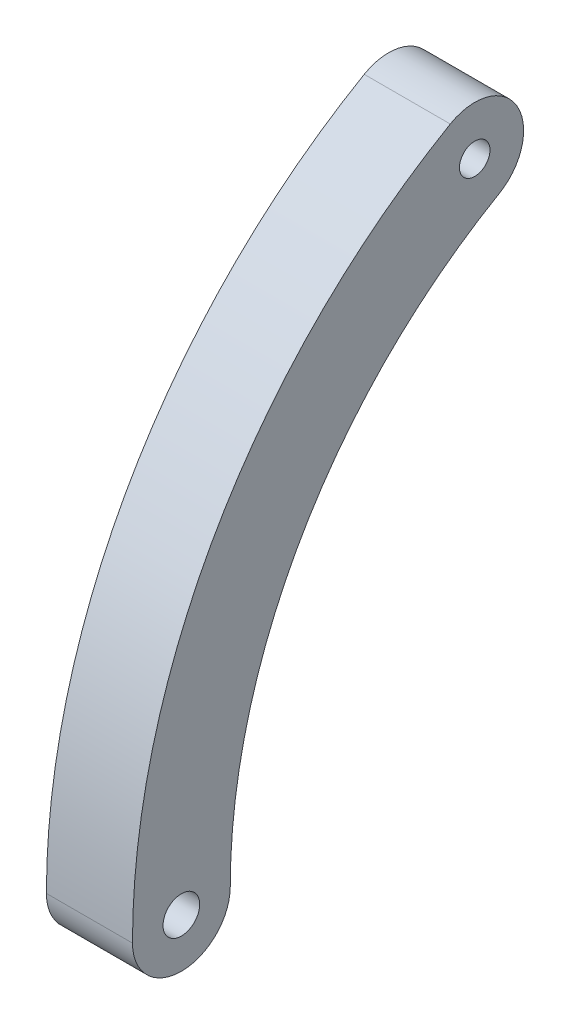
ISO-10303-21;
HEADER;
FILE_DESCRIPTION(('STEP AP214'),'2;1');
FILE_NAME('part.step','',(''),(''),'','','');
FILE_SCHEMA(('AUTOMOTIVE_DESIGN { 1 0 10303 214 1 1 1 1 }'));
ENDSEC;
DATA;
#1=APPLICATION_CONTEXT('core data for automotive mechanical design processes');
#2=APPLICATION_PROTOCOL_DEFINITION('international standard','automotive_design',2000,#1);
#3=PRODUCT_CONTEXT('',#1,'mechanical');
#4=PRODUCT('Part','Part','',(#3));
#5=PRODUCT_RELATED_PRODUCT_CATEGORY('part','',(#4));
#6=PRODUCT_DEFINITION_FORMATION('','',#4);
#7=PRODUCT_DEFINITION_CONTEXT('part definition',#1,'design');
#8=PRODUCT_DEFINITION('design','',#6,#7);
#9=PRODUCT_DEFINITION_SHAPE('','',#8);
#10=(LENGTH_UNIT() NAMED_UNIT(*) SI_UNIT(.MILLI.,.METRE.));
#11=(NAMED_UNIT(*) PLANE_ANGLE_UNIT() SI_UNIT($,.RADIAN.));
#12=(NAMED_UNIT(*) SI_UNIT($,.STERADIAN.) SOLID_ANGLE_UNIT());
#13=UNCERTAINTY_MEASURE_WITH_UNIT(LENGTH_MEASURE(1.E-05),#10,'distance_accuracy_value','');
#14=(GEOMETRIC_REPRESENTATION_CONTEXT(3) GLOBAL_UNCERTAINTY_ASSIGNED_CONTEXT((#13)) GLOBAL_UNIT_ASSIGNED_CONTEXT((#10,
#11,#12)) REPRESENTATION_CONTEXT('',''));
#15=CARTESIAN_POINT('',(0.,0.,0.));
#16=DIRECTION('',(0.,0.,1.));
#17=DIRECTION('',(1.,0.,0.));
#18=AXIS2_PLACEMENT_3D('',#15,#16,#17);
#19=CARTESIAN_POINT('',(5.588,0.,19.05));
#20=DIRECTION('',(1.,0.,0.));
#21=DIRECTION('',(0.,0.,-1.));
#22=AXIS2_PLACEMENT_3D('',#19,#20,#21);
#23=PLANE('',#22);
#24=CARTESIAN_POINT('',(5.588,32.9955678841871,19.05));
#25=DIRECTION('',(1.,0.,0.));
#26=DIRECTION('',(0.,0.,-1.));
#27=AXIS2_PLACEMENT_3D('',#24,#25,#26);
#28=CIRCLE('',#27,0.992187499999997);
#29=CARTESIAN_POINT('',(5.588,32.9955678841871,18.0578125));
#30=VERTEX_POINT('',#29);
#31=EDGE_CURVE('E102',#30,#30,#28,.T.);
#32=ORIENTED_EDGE('',*,*,#31,.F.);
#33=EDGE_LOOP('',(#32));
#34=FACE_BOUND('',#33,.T.);
#35=CARTESIAN_POINT('',(5.588,0.,38.1));
#36=DIRECTION('',(1.,0.,0.));
#37=DIRECTION('',(0.,0.,-1.));
#38=AXIS2_PLACEMENT_3D('',#35,#36,#37);
#39=CIRCLE('',#38,3.175);
#40=CARTESIAN_POINT('',(5.588,0.,41.275));
#41=VERTEX_POINT('',#40);
#42=CARTESIAN_POINT('',(5.588,0.,34.925));
#43=VERTEX_POINT('',#42);
#44=EDGE_CURVE('E87',#41,#43,#39,.T.);
#45=ORIENTED_EDGE('',*,*,#44,.T.);
#46=CARTESIAN_POINT('',(5.588,0.,0.));
#47=DIRECTION('',(-1.,0.,0.));
#48=DIRECTION('',(0.,0.,1.));
#49=AXIS2_PLACEMENT_3D('',#46,#47,#48);
#50=CIRCLE('',#49,34.925);
#51=CARTESIAN_POINT('',(5.588,30.2459372271715,17.4625));
#52=VERTEX_POINT('',#51);
#53=EDGE_CURVE('E82',#43,#52,#50,.T.);
#54=ORIENTED_EDGE('',*,*,#53,.T.);
#55=CARTESIAN_POINT('',(5.588,32.9955678841871,19.05));
#56=DIRECTION('',(1.,0.,0.));
#57=DIRECTION('',(0.,0.,-1.));
#58=AXIS2_PLACEMENT_3D('',#55,#56,#57);
#59=CIRCLE('',#58,3.175);
#60=CARTESIAN_POINT('',(5.588,35.7451985412027,20.6375));
#61=VERTEX_POINT('',#60);
#62=EDGE_CURVE('E85',#52,#61,#59,.T.);
#63=ORIENTED_EDGE('',*,*,#62,.T.);
#64=CARTESIAN_POINT('',(5.588,0.,0.));
#65=DIRECTION('',(1.,0.,0.));
#66=DIRECTION('',(0.,0.,1.));
#67=AXIS2_PLACEMENT_3D('',#64,#65,#66);
#68=CIRCLE('',#67,41.275);
#69=EDGE_CURVE('E52',#61,#41,#68,.T.);
#70=ORIENTED_EDGE('',*,*,#69,.T.);
#71=EDGE_LOOP('',(#45,#54,#63,#70));
#72=FACE_BOUND('',#71,.T.);
#73=CARTESIAN_POINT('',(5.588,0.,38.1));
#74=DIRECTION('',(1.,0.,0.));
#75=DIRECTION('',(0.,0.,-1.));
#76=AXIS2_PLACEMENT_3D('',#73,#74,#75);
#77=CIRCLE('',#76,1.190625);
#78=CARTESIAN_POINT('',(5.588,0.,36.909375));
#79=VERTEX_POINT('',#78);
#80=EDGE_CURVE('E117',#79,#79,#77,.T.);
#81=ORIENTED_EDGE('',*,*,#80,.F.);
#82=EDGE_LOOP('',(#81));
#83=FACE_BOUND('',#82,.T.);
#84=ADVANCED_FACE('F35',(#34,#72,#83),#23,.T.);
#85=CARTESIAN_POINT('',(0.,0.,19.05));
#86=DIRECTION('',(1.,0.,0.));
#87=DIRECTION('',(0.,0.,-1.));
#88=AXIS2_PLACEMENT_3D('',#85,#86,#87);
#89=PLANE('',#88);
#90=CARTESIAN_POINT('',(0.,0.,38.1));
#91=DIRECTION('',(1.,0.,0.));
#92=DIRECTION('',(0.,0.,-1.));
#93=AXIS2_PLACEMENT_3D('',#90,#91,#92);
#94=CIRCLE('',#93,3.175);
#95=CARTESIAN_POINT('',(0.,0.,41.275));
#96=VERTEX_POINT('',#95);
#97=CARTESIAN_POINT('',(0.,0.,34.925));
#98=VERTEX_POINT('',#97);
#99=EDGE_CURVE('E99',#96,#98,#94,.T.);
#100=ORIENTED_EDGE('',*,*,#99,.F.);
#101=CARTESIAN_POINT('',(0.,0.,0.));
#102=DIRECTION('',(1.,0.,0.));
#103=DIRECTION('',(0.,0.,1.));
#104=AXIS2_PLACEMENT_3D('',#101,#102,#103);
#105=CIRCLE('',#104,41.275);
#106=CARTESIAN_POINT('',(0.,35.7451985412027,20.6375));
#107=VERTEX_POINT('',#106);
#108=EDGE_CURVE('E75',#107,#96,#105,.T.);
#109=ORIENTED_EDGE('',*,*,#108,.F.);
#110=CARTESIAN_POINT('',(0.,32.9955678841871,19.05));
#111=DIRECTION('',(1.,0.,0.));
#112=DIRECTION('',(0.,0.,-1.));
#113=AXIS2_PLACEMENT_3D('',#110,#111,#112);
#114=CIRCLE('',#113,3.175);
#115=CARTESIAN_POINT('',(0.,30.2459372271715,17.4625));
#116=VERTEX_POINT('',#115);
#117=EDGE_CURVE('E69',#116,#107,#114,.T.);
#118=ORIENTED_EDGE('',*,*,#117,.F.);
#119=CARTESIAN_POINT('',(0.,0.,0.));
#120=DIRECTION('',(-1.,0.,0.));
#121=DIRECTION('',(0.,0.,1.));
#122=AXIS2_PLACEMENT_3D('',#119,#120,#121);
#123=CIRCLE('',#122,34.925);
#124=EDGE_CURVE('E91',#98,#116,#123,.T.);
#125=ORIENTED_EDGE('',*,*,#124,.F.);
#126=EDGE_LOOP('',(#100,#109,#118,#125));
#127=FACE_BOUND('',#126,.T.);
#128=CARTESIAN_POINT('',(0.,32.9955678841871,19.05));
#129=DIRECTION('',(1.,0.,0.));
#130=DIRECTION('',(0.,0.,-1.));
#131=AXIS2_PLACEMENT_3D('',#128,#129,#130);
#132=CIRCLE('',#131,0.992187499999997);
#133=CARTESIAN_POINT('',(0.,32.9955678841871,18.0578125));
#134=VERTEX_POINT('',#133);
#135=EDGE_CURVE('E114',#134,#134,#132,.T.);
#136=ORIENTED_EDGE('',*,*,#135,.T.);
#137=EDGE_LOOP('',(#136));
#138=FACE_BOUND('',#137,.T.);
#139=CARTESIAN_POINT('',(0.,0.,38.1));
#140=DIRECTION('',(1.,0.,0.));
#141=DIRECTION('',(0.,0.,-1.));
#142=AXIS2_PLACEMENT_3D('',#139,#140,#141);
#143=CIRCLE('',#142,1.190625);
#144=CARTESIAN_POINT('',(0.,0.,36.909375));
#145=VERTEX_POINT('',#144);
#146=EDGE_CURVE('E120',#145,#145,#143,.T.);
#147=ORIENTED_EDGE('',*,*,#146,.T.);
#148=EDGE_LOOP('',(#147));
#149=FACE_BOUND('',#148,.T.);
#150=ADVANCED_FACE('F110',(#127,#138,#149),#89,.F.);
#151=CARTESIAN_POINT('',(5.588,0.,38.1));
#152=DIRECTION('',(-1.,0.,0.));
#153=DIRECTION('',(0.,0.,1.));
#154=AXIS2_PLACEMENT_3D('',#151,#152,#153);
#155=CYLINDRICAL_SURFACE('',#154,3.175);
#156=ORIENTED_EDGE('',*,*,#99,.T.);
#157=DIRECTION('',(-1.,0.,0.));
#158=VECTOR('',#157,1.);
#159=CARTESIAN_POINT('',(5.588,0.,34.925));
#160=LINE('',#159,#158);
#161=EDGE_CURVE('E11',#43,#98,#160,.T.);
#162=ORIENTED_EDGE('',*,*,#161,.F.);
#163=ORIENTED_EDGE('',*,*,#44,.F.);
#164=DIRECTION('',(-1.,0.,0.));
#165=VECTOR('',#164,1.);
#166=CARTESIAN_POINT('',(5.588,0.,41.275));
#167=LINE('',#166,#165);
#168=EDGE_CURVE('E95',#41,#96,#167,.T.);
#169=ORIENTED_EDGE('',*,*,#168,.T.);
#170=EDGE_LOOP('',(#156,#162,#163,#169));
#171=FACE_BOUND('',#170,.T.);
#172=ADVANCED_FACE('F37',(#171),#155,.T.);
#173=CARTESIAN_POINT('',(5.588,0.,0.));
#174=DIRECTION('',(-1.,0.,0.));
#175=DIRECTION('',(0.,0.,1.));
#176=AXIS2_PLACEMENT_3D('',#173,#174,#175);
#177=CYLINDRICAL_SURFACE('',#176,34.925);
#178=ORIENTED_EDGE('',*,*,#124,.T.);
#179=DIRECTION('',(-1.,0.,0.));
#180=VECTOR('',#179,1.);
#181=CARTESIAN_POINT('',(5.588,30.2459372271715,17.4625));
#182=LINE('',#181,#180);
#183=EDGE_CURVE('E44',#52,#116,#182,.T.);
#184=ORIENTED_EDGE('',*,*,#183,.F.);
#185=ORIENTED_EDGE('',*,*,#53,.F.);
#186=ORIENTED_EDGE('',*,*,#161,.T.);
#187=EDGE_LOOP('',(#178,#184,#185,#186));
#188=FACE_BOUND('',#187,.T.);
#189=ADVANCED_FACE('F90',(#188),#177,.F.);
#190=CARTESIAN_POINT('',(5.588,32.9955678841871,19.05));
#191=DIRECTION('',(-1.,0.,0.));
#192=DIRECTION('',(0.,0.,1.));
#193=AXIS2_PLACEMENT_3D('',#190,#191,#192);
#194=CYLINDRICAL_SURFACE('',#193,3.175);
#195=ORIENTED_EDGE('',*,*,#117,.T.);
#196=DIRECTION('',(-1.,0.,0.));
#197=VECTOR('',#196,1.);
#198=CARTESIAN_POINT('',(5.588,35.7451985412027,20.6375));
#199=LINE('',#198,#197);
#200=EDGE_CURVE('E92',#61,#107,#199,.T.);
#201=ORIENTED_EDGE('',*,*,#200,.F.);
#202=ORIENTED_EDGE('',*,*,#62,.F.);
#203=ORIENTED_EDGE('',*,*,#183,.T.);
#204=EDGE_LOOP('',(#195,#201,#202,#203));
#205=FACE_BOUND('',#204,.T.);
#206=ADVANCED_FACE('F93',(#205),#194,.T.);
#207=CARTESIAN_POINT('',(5.588,0.,0.));
#208=DIRECTION('',(-1.,0.,0.));
#209=DIRECTION('',(0.,0.,1.));
#210=AXIS2_PLACEMENT_3D('',#207,#208,#209);
#211=CYLINDRICAL_SURFACE('',#210,41.275);
#212=ORIENTED_EDGE('',*,*,#108,.T.);
#213=ORIENTED_EDGE('',*,*,#168,.F.);
#214=ORIENTED_EDGE('',*,*,#69,.F.);
#215=ORIENTED_EDGE('',*,*,#200,.T.);
#216=EDGE_LOOP('',(#212,#213,#214,#215));
#217=FACE_BOUND('',#216,.T.);
#218=ADVANCED_FACE('F107',(#217),#211,.T.);
#219=CARTESIAN_POINT('',(5.588,32.9955678841871,19.05));
#220=DIRECTION('',(-1.,0.,0.));
#221=DIRECTION('',(0.,0.,1.));
#222=AXIS2_PLACEMENT_3D('',#219,#220,#221);
#223=CYLINDRICAL_SURFACE('',#222,0.992187499999997);
#224=ORIENTED_EDGE('',*,*,#31,.T.);
#225=EDGE_LOOP('',(#224));
#226=FACE_BOUND('',#225,.T.);
#227=ORIENTED_EDGE('',*,*,#135,.F.);
#228=EDGE_LOOP('',(#227));
#229=FACE_BOUND('',#228,.T.);
#230=ADVANCED_FACE('F137',(#226,#229),#223,.F.);
#231=CARTESIAN_POINT('',(5.588,0.,38.1));
#232=DIRECTION('',(-1.,0.,0.));
#233=DIRECTION('',(0.,0.,1.));
#234=AXIS2_PLACEMENT_3D('',#231,#232,#233);
#235=CYLINDRICAL_SURFACE('',#234,1.190625);
#236=ORIENTED_EDGE('',*,*,#80,.T.);
#237=EDGE_LOOP('',(#236));
#238=FACE_BOUND('',#237,.T.);
#239=ORIENTED_EDGE('',*,*,#146,.F.);
#240=EDGE_LOOP('',(#239));
#241=FACE_BOUND('',#240,.T.);
#242=ADVANCED_FACE('F126',(#238,#241),#235,.F.);
#243=CLOSED_SHELL('',(#84,#150,#172,#189,#206,#218,#230,#242));
#244=MANIFOLD_SOLID_BREP('B2',#243);
#245=ADVANCED_BREP_SHAPE_REPRESENTATION('',(#18,#244),#14);
#246=SHAPE_DEFINITION_REPRESENTATION(#9,#245);
ENDSEC;
END-ISO-10303-21;
